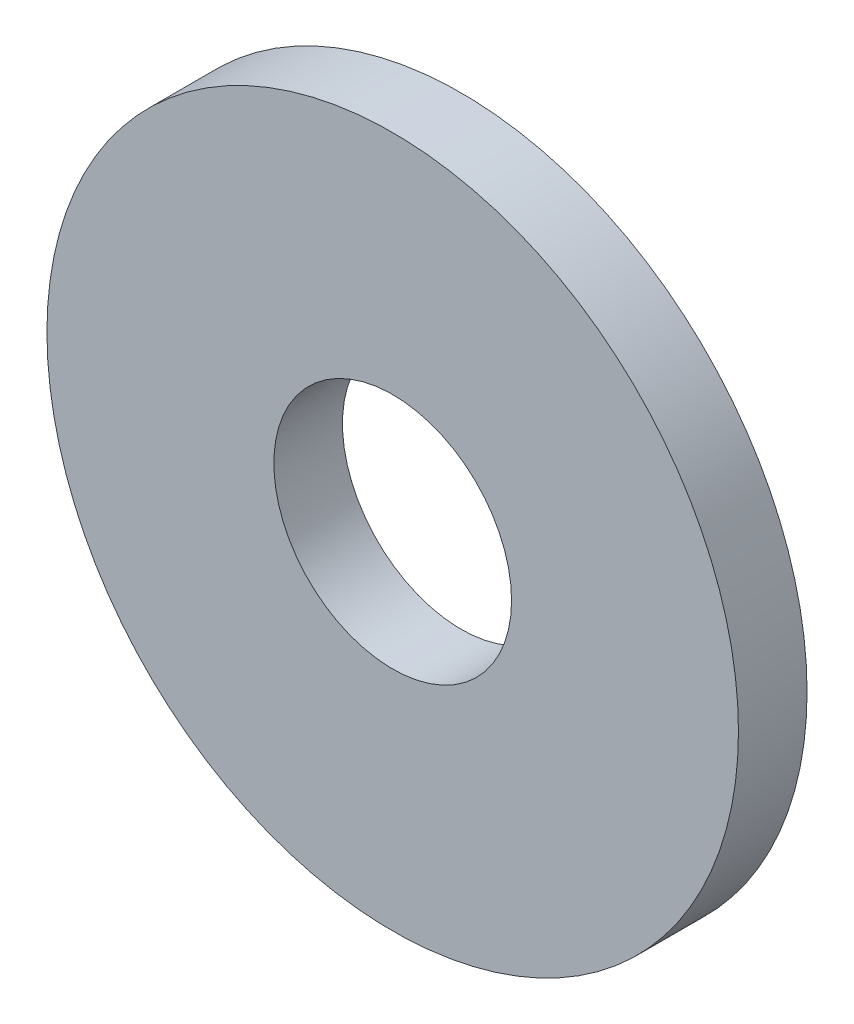
ISO-10303-21;
HEADER;
FILE_DESCRIPTION(('STEP AP214'),'2;1');
FILE_NAME('part.step','',(''),(''),'','','');
FILE_SCHEMA(('AUTOMOTIVE_DESIGN { 1 0 10303 214 1 1 1 1 }'));
ENDSEC;
DATA;
#1=APPLICATION_CONTEXT('core data for automotive mechanical design processes');
#2=APPLICATION_PROTOCOL_DEFINITION('international standard','automotive_design',2000,#1);
#3=PRODUCT_CONTEXT('',#1,'mechanical');
#4=PRODUCT('Part','Part','',(#3));
#5=PRODUCT_RELATED_PRODUCT_CATEGORY('part','',(#4));
#6=PRODUCT_DEFINITION_FORMATION('','',#4);
#7=PRODUCT_DEFINITION_CONTEXT('part definition',#1,'design');
#8=PRODUCT_DEFINITION('design','',#6,#7);
#9=PRODUCT_DEFINITION_SHAPE('','',#8);
#10=(LENGTH_UNIT() NAMED_UNIT(*) SI_UNIT(.MILLI.,.METRE.));
#11=(NAMED_UNIT(*) PLANE_ANGLE_UNIT() SI_UNIT($,.RADIAN.));
#12=(NAMED_UNIT(*) SI_UNIT($,.STERADIAN.) SOLID_ANGLE_UNIT());
#13=UNCERTAINTY_MEASURE_WITH_UNIT(LENGTH_MEASURE(1.E-05),#10,'distance_accuracy_value','');
#14=(GEOMETRIC_REPRESENTATION_CONTEXT(3) GLOBAL_UNCERTAINTY_ASSIGNED_CONTEXT((#13)) GLOBAL_UNIT_ASSIGNED_CONTEXT((#10,
#11,#12)) REPRESENTATION_CONTEXT('',''));
#15=CARTESIAN_POINT('',(0.,0.,0.));
#16=DIRECTION('',(0.,0.,1.));
#17=DIRECTION('',(1.,0.,0.));
#18=AXIS2_PLACEMENT_3D('',#15,#16,#17);
#19=CARTESIAN_POINT('',(0.,0.,6.35));
#20=DIRECTION('',(0.,0.,1.));
#21=DIRECTION('',(1.,0.,0.));
#22=AXIS2_PLACEMENT_3D('',#19,#20,#21);
#23=PLANE('',#22);
#24=CARTESIAN_POINT('',(0.,0.,6.35));
#25=DIRECTION('',(0.,0.,1.));
#26=DIRECTION('',(1.,0.,0.));
#27=AXIS2_PLACEMENT_3D('',#24,#25,#26);
#28=CIRCLE('',#27,32.);
#29=CARTESIAN_POINT('',(32.,0.,6.35));
#30=VERTEX_POINT('',#29);
#31=EDGE_CURVE('E10',#30,#30,#28,.T.);
#32=ORIENTED_EDGE('',*,*,#31,.T.);
#33=EDGE_LOOP('',(#32));
#34=FACE_BOUND('',#33,.T.);
#35=CARTESIAN_POINT('',(0.,0.,6.35));
#36=DIRECTION('',(0.,0.,1.));
#37=DIRECTION('',(1.,0.,0.));
#38=AXIS2_PLACEMENT_3D('',#35,#36,#37);
#39=CIRCLE('',#38,11.);
#40=CARTESIAN_POINT('',(11.,0.,6.35));
#41=VERTEX_POINT('',#40);
#42=EDGE_CURVE('E50',#41,#41,#39,.T.);
#43=ORIENTED_EDGE('',*,*,#42,.F.);
#44=EDGE_LOOP('',(#43));
#45=FACE_BOUND('',#44,.T.);
#46=ADVANCED_FACE('F37',(#34,#45),#23,.T.);
#47=CARTESIAN_POINT('',(0.,0.,0.));
#48=DIRECTION('',(0.,0.,1.));
#49=DIRECTION('',(1.,0.,0.));
#50=AXIS2_PLACEMENT_3D('',#47,#48,#49);
#51=PLANE('',#50);
#52=CARTESIAN_POINT('',(0.,0.,0.));
#53=DIRECTION('',(0.,0.,1.));
#54=DIRECTION('',(1.,0.,0.));
#55=AXIS2_PLACEMENT_3D('',#52,#53,#54);
#56=CIRCLE('',#55,32.);
#57=CARTESIAN_POINT('',(32.,0.,0.));
#58=VERTEX_POINT('',#57);
#59=EDGE_CURVE('E41',#58,#58,#56,.T.);
#60=ORIENTED_EDGE('',*,*,#59,.F.);
#61=EDGE_LOOP('',(#60));
#62=FACE_BOUND('',#61,.T.);
#63=CARTESIAN_POINT('',(0.,0.,0.));
#64=DIRECTION('',(0.,0.,1.));
#65=DIRECTION('',(1.,0.,0.));
#66=AXIS2_PLACEMENT_3D('',#63,#64,#65);
#67=CIRCLE('',#66,11.);
#68=CARTESIAN_POINT('',(11.,0.,0.));
#69=VERTEX_POINT('',#68);
#70=EDGE_CURVE('E52',#69,#69,#67,.T.);
#71=ORIENTED_EDGE('',*,*,#70,.T.);
#72=EDGE_LOOP('',(#71));
#73=FACE_BOUND('',#72,.T.);
#74=ADVANCED_FACE('F64',(#62,#73),#51,.F.);
#75=CARTESIAN_POINT('',(0.,0.,6.35));
#76=DIRECTION('',(0.,0.,-1.));
#77=DIRECTION('',(-1.,0.,0.));
#78=AXIS2_PLACEMENT_3D('',#75,#76,#77);
#79=CYLINDRICAL_SURFACE('',#78,32.);
#80=ORIENTED_EDGE('',*,*,#31,.F.);
#81=EDGE_LOOP('',(#80));
#82=FACE_BOUND('',#81,.T.);
#83=ORIENTED_EDGE('',*,*,#59,.T.);
#84=EDGE_LOOP('',(#83));
#85=FACE_BOUND('',#84,.T.);
#86=ADVANCED_FACE('F39',(#82,#85),#79,.T.);
#87=CARTESIAN_POINT('',(0.,0.,6.35));
#88=DIRECTION('',(0.,0.,-1.));
#89=DIRECTION('',(-1.,0.,0.));
#90=AXIS2_PLACEMENT_3D('',#87,#88,#89);
#91=CYLINDRICAL_SURFACE('',#90,11.);
#92=ORIENTED_EDGE('',*,*,#42,.T.);
#93=EDGE_LOOP('',(#92));
#94=FACE_BOUND('',#93,.T.);
#95=ORIENTED_EDGE('',*,*,#70,.F.);
#96=EDGE_LOOP('',(#95));
#97=FACE_BOUND('',#96,.T.);
#98=ADVANCED_FACE('F60',(#94,#97),#91,.F.);
#99=CLOSED_SHELL('',(#46,#74,#86,#98));
#100=MANIFOLD_SOLID_BREP('B2',#99);
#101=ADVANCED_BREP_SHAPE_REPRESENTATION('',(#18,#100),#14);
#102=SHAPE_DEFINITION_REPRESENTATION(#9,#101);
ENDSEC;
END-ISO-10303-21;
